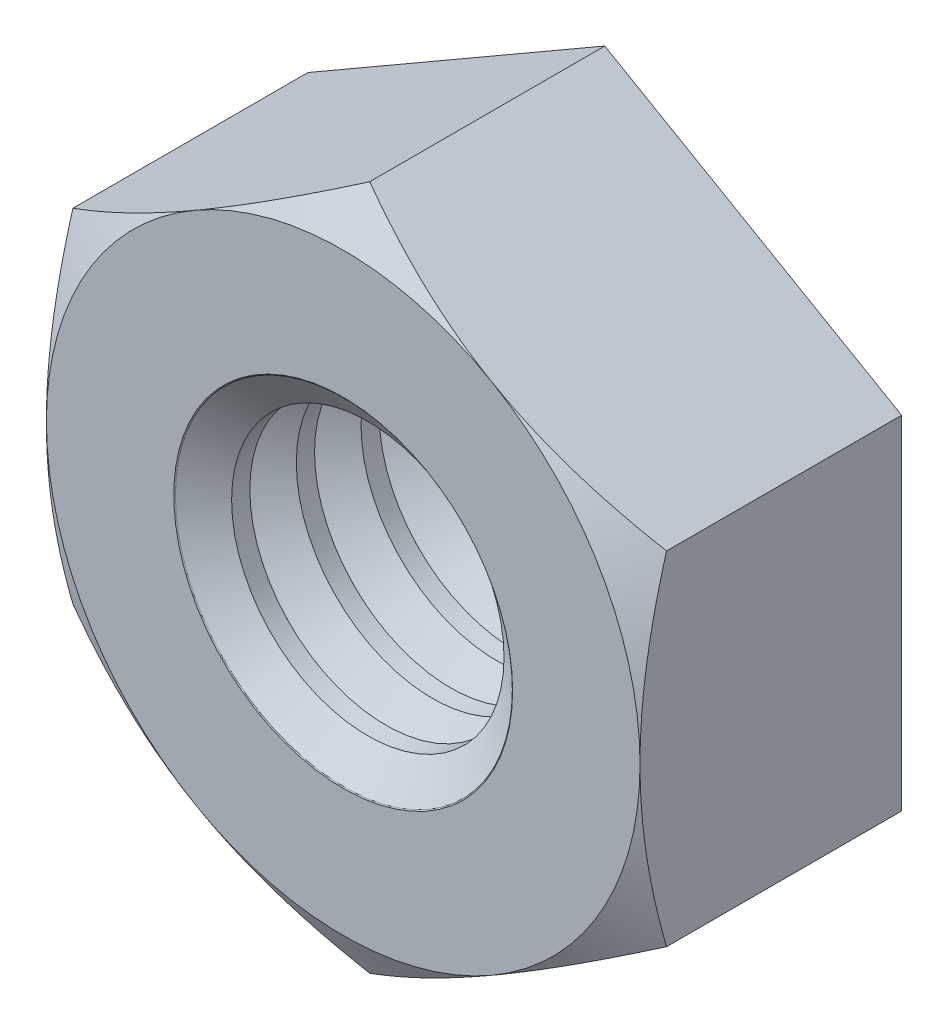
ISO-10303-21;
HEADER;
FILE_DESCRIPTION(('STEP AP214'),'2;1');
FILE_NAME('part.step','',(''),(''),'','','');
FILE_SCHEMA(('AUTOMOTIVE_DESIGN { 1 0 10303 214 1 1 1 1 }'));
ENDSEC;
DATA;
#1=APPLICATION_CONTEXT('core data for automotive mechanical design processes');
#2=APPLICATION_PROTOCOL_DEFINITION('international standard','automotive_design',2000,#1);
#3=PRODUCT_CONTEXT('',#1,'mechanical');
#4=PRODUCT('Part','Part','',(#3));
#5=PRODUCT_RELATED_PRODUCT_CATEGORY('part','',(#4));
#6=PRODUCT_DEFINITION_FORMATION('','',#4);
#7=PRODUCT_DEFINITION_CONTEXT('part definition',#1,'design');
#8=PRODUCT_DEFINITION('design','',#6,#7);
#9=PRODUCT_DEFINITION_SHAPE('','',#8);
#10=(LENGTH_UNIT() NAMED_UNIT(*) SI_UNIT(.MILLI.,.METRE.));
#11=(NAMED_UNIT(*) PLANE_ANGLE_UNIT() SI_UNIT($,.RADIAN.));
#12=(NAMED_UNIT(*) SI_UNIT($,.STERADIAN.) SOLID_ANGLE_UNIT());
#13=UNCERTAINTY_MEASURE_WITH_UNIT(LENGTH_MEASURE(1.E-05),#10,'distance_accuracy_value','');
#14=(GEOMETRIC_REPRESENTATION_CONTEXT(3) GLOBAL_UNCERTAINTY_ASSIGNED_CONTEXT((#13)) GLOBAL_UNIT_ASSIGNED_CONTEXT((#10,
#11,#12)) REPRESENTATION_CONTEXT('',''));
#15=CARTESIAN_POINT('',(0.,0.,0.));
#16=DIRECTION('',(0.,0.,1.));
#17=DIRECTION('',(1.,0.,0.));
#18=AXIS2_PLACEMENT_3D('',#15,#16,#17);
#19=CARTESIAN_POINT('',(0.,0.,-4.9022));
#20=DIRECTION('',(0.,0.,1.));
#21=DIRECTION('',(1.,0.,0.));
#22=AXIS2_PLACEMENT_3D('',#19,#20,#21);
#23=CYLINDRICAL_SURFACE('',#22,2.5527);
#24=CARTESIAN_POINT('',(0.,0.,-4.09968915102791));
#25=DIRECTION('',(0.,0.,-1.));
#26=DIRECTION('',(-1.,0.,0.));
#27=AXIS2_PLACEMENT_3D('',#24,#25,#26);
#28=CIRCLE('',#27,2.5527);
#29=CARTESIAN_POINT('',(-2.5527,0.,-4.09968915102791));
#30=VERTEX_POINT('',#29);
#31=EDGE_CURVE('E618',#30,#30,#28,.T.);
#32=ORIENTED_EDGE('',*,*,#31,.F.);
#33=EDGE_LOOP('',(#32));
#34=FACE_BOUND('',#33,.T.);
#35=CARTESIAN_POINT('',(0.,0.,-4.44106084897209));
#36=DIRECTION('',(0.,0.,-1.));
#37=DIRECTION('',(-1.,0.,0.));
#38=AXIS2_PLACEMENT_3D('',#35,#36,#37);
#39=CIRCLE('',#38,2.5527);
#40=CARTESIAN_POINT('',(-2.5527,0.,-4.44106084897209));
#41=VERTEX_POINT('',#40);
#42=EDGE_CURVE('E275',#41,#41,#39,.F.);
#43=ORIENTED_EDGE('',*,*,#42,.F.);
#44=EDGE_LOOP('',(#43));
#45=FACE_BOUND('',#44,.T.);
#46=ADVANCED_FACE('F38',(#34,#45),#23,.F.);
#47=CARTESIAN_POINT('',(0.,0.,-3.22821084897211));
#48=DIRECTION('',(0.,0.,-1.));
#49=DIRECTION('',(-1.,0.,0.));
#50=AXIS2_PLACEMENT_3D('',#47,#48,#49);
#51=CIRCLE('',#50,2.5527);
#52=CARTESIAN_POINT('',(-2.5527,0.,-3.22821084897211));
#53=VERTEX_POINT('',#52);
#54=EDGE_CURVE('E620',#53,#53,#51,.T.);
#55=ORIENTED_EDGE('',*,*,#54,.T.);
#56=EDGE_LOOP('',(#55));
#57=FACE_BOUND('',#56,.T.);
#58=CARTESIAN_POINT('',(0.,0.,-2.88683915102791));
#59=DIRECTION('',(0.,0.,-1.));
#60=DIRECTION('',(-1.,0.,0.));
#61=AXIS2_PLACEMENT_3D('',#58,#59,#60);
#62=CIRCLE('',#61,2.5527);
#63=CARTESIAN_POINT('',(-2.5527,0.,-2.88683915102791));
#64=VERTEX_POINT('',#63);
#65=EDGE_CURVE('E633',#64,#64,#62,.T.);
#66=ORIENTED_EDGE('',*,*,#65,.F.);
#67=EDGE_LOOP('',(#66));
#68=FACE_BOUND('',#67,.T.);
#69=ADVANCED_FACE('F228',(#57,#68),#23,.F.);
#70=CARTESIAN_POINT('',(0.,0.,-2.01536084897211));
#71=DIRECTION('',(0.,0.,-1.));
#72=DIRECTION('',(-1.,0.,0.));
#73=AXIS2_PLACEMENT_3D('',#70,#71,#72);
#74=CIRCLE('',#73,2.5527);
#75=CARTESIAN_POINT('',(-2.5527,0.,-2.01536084897211));
#76=VERTEX_POINT('',#75);
#77=EDGE_CURVE('E625',#76,#76,#74,.T.);
#78=ORIENTED_EDGE('',*,*,#77,.T.);
#79=EDGE_LOOP('',(#78));
#80=FACE_BOUND('',#79,.T.);
#81=CARTESIAN_POINT('',(0.,0.,-1.67398915102791));
#82=DIRECTION('',(0.,0.,-1.));
#83=DIRECTION('',(-1.,0.,0.));
#84=AXIS2_PLACEMENT_3D('',#81,#82,#83);
#85=CIRCLE('',#84,2.5527);
#86=CARTESIAN_POINT('',(-2.5527,0.,-1.67398915102791));
#87=VERTEX_POINT('',#86);
#88=EDGE_CURVE('E264',#87,#87,#85,.T.);
#89=ORIENTED_EDGE('',*,*,#88,.F.);
#90=EDGE_LOOP('',(#89));
#91=FACE_BOUND('',#90,.T.);
#92=ADVANCED_FACE('F233',(#80,#91),#23,.F.);
#93=CARTESIAN_POINT('',(0.,0.,-0.802510848972107));
#94=DIRECTION('',(0.,0.,-1.));
#95=DIRECTION('',(-1.,0.,0.));
#96=AXIS2_PLACEMENT_3D('',#93,#94,#95);
#97=CIRCLE('',#96,2.5527);
#98=CARTESIAN_POINT('',(-2.5527,0.,-0.802510848972107));
#99=VERTEX_POINT('',#98);
#100=EDGE_CURVE('E249',#99,#99,#97,.T.);
#101=ORIENTED_EDGE('',*,*,#100,.T.);
#102=EDGE_LOOP('',(#101));
#103=FACE_BOUND('',#102,.T.);
#104=CARTESIAN_POINT('',(0.,0.,-0.461139151027908));
#105=DIRECTION('',(0.,0.,-1.));
#106=DIRECTION('',(-1.,0.,0.));
#107=AXIS2_PLACEMENT_3D('',#104,#105,#106);
#108=CIRCLE('',#107,2.5527);
#109=CARTESIAN_POINT('',(-2.5527,0.,-0.461139151027908));
#110=VERTEX_POINT('',#109);
#111=EDGE_CURVE('E252',#110,#110,#108,.T.);
#112=ORIENTED_EDGE('',*,*,#111,.F.);
#113=EDGE_LOOP('',(#112));
#114=FACE_BOUND('',#113,.T.);
#115=ADVANCED_FACE('F188',(#103,#114),#23,.F.);
#116=CARTESIAN_POINT('',(0.,6.42313721478843,-4.9022));
#117=DIRECTION('',(-0.500000000000001,0.866025403784438,0.));
#118=DIRECTION('',(-0.866025403784438,-0.500000000000001,0.));
#119=AXIS2_PLACEMENT_3D('',#116,#117,#118);
#120=PLANE('',#119);
#121=DIRECTION('',(0.,0.,1.));
#122=VECTOR('',#121,1.);
#123=CARTESIAN_POINT('',(-5.5626,3.21156860739421,-4.9022));
#124=LINE('',#123,#122);
#125=CARTESIAN_POINT('',(-5.5626,3.21156860739421,-4.9022));
#126=VERTEX_POINT('',#125);
#127=CARTESIAN_POINT('',(-5.5626,3.21156860739421,-0.49683139260579));
#128=VERTEX_POINT('',#127);
#129=EDGE_CURVE('E290',#126,#128,#124,.T.);
#130=ORIENTED_EDGE('',*,*,#129,.T.);
#131=CARTESIAN_POINT('',(-5.5628,3.21145313734037,-0.496898061070143));
#132=CARTESIAN_POINT('',(-5.44052742579051,3.28204724097473,-0.45614620225513));
#133=CARTESIAN_POINT('',(-5.31779895987524,3.35290455380814,-0.417243775308723));
#134=CARTESIAN_POINT('',(-5.07134533701076,3.49519461931171,-0.343647161560542));
#135=CARTESIAN_POINT('',(-4.9476197744618,3.56662760615499,-0.308954790139043));
#136=CARTESIAN_POINT('',(-4.57446205540738,3.78207031570124,-0.211873701066853));
#137=CARTESIAN_POINT('',(-4.32355690787704,3.92693047016895,-0.156654841923371));
#138=CARTESIAN_POINT('',(-3.94808191278054,4.14371105966188,-0.0919037861815263));
#139=CARTESIAN_POINT('',(-3.8246339686256,4.21498376345064,-0.0734579983429324));
#140=CARTESIAN_POINT('',(-3.57718026600868,4.3578512252685,-0.0425268916674606));
#141=CARTESIAN_POINT('',(-3.45317455781052,4.42944595427775,-0.030041046189007));
#142=CARTESIAN_POINT('',(-3.20494775357179,4.57275976652507,-0.0113480299394697));
#143=CARTESIAN_POINT('',(-3.08072706298072,4.64447861567674,-0.0051337334058461));
#144=CARTESIAN_POINT('',(-2.8321777704527,4.78797861662468,0.000889599359096276));
#145=CARTESIAN_POINT('',(-2.70784917196775,4.85975976642794,0.000698833448296866));
#146=CARTESIAN_POINT('',(-2.36722460466015,5.05641945205558,-0.00862810136342291));
#147=CARTESIAN_POINT('',(-2.15104012289184,5.18123362079914,-0.0242873955350765));
#148=CARTESIAN_POINT('',(-1.72010704725998,5.4300329480179,-0.0739443233816071));
#149=CARTESIAN_POINT('',(-1.50535996905277,5.55401723142852,-0.10795893142346));
#150=CARTESIAN_POINT('',(-1.0735595573113,5.80331731538365,-0.19298604140968));
#151=CARTESIAN_POINT('',(-0.856560712116212,5.92860165707087,-0.244358813937405));
#152=CARTESIAN_POINT('',(-0.425799188774084,6.17730193852898,-0.360954456999598));
#153=CARTESIAN_POINT('',(-0.212030993492364,6.30072106361907,-0.426149937617064));
#154=CARTESIAN_POINT('',(0.000199999999999103,6.42325268484226,-0.496898061070144));
#155=B_SPLINE_CURVE_WITH_KNOTS('',3,(#131,#132,#133,#134,#135,#136,#137,#138,#139,#140,#141,
#142,#143,#144,#145,#146,#147,#148,#149,#150,#151,#152,#153,#154),.UNSPECIFIED.,.F.,.F.,(4,2,2,
2,2,2,2,2,2,2,2,4),(0.,0.44082011856227,0.881829648847401,1.76568130465017,2.19678242164486,
2.62784543796583,3.05841812523868,3.48897751176353,4.23854798324166,4.98881282275669,
5.75571809391027,6.52111769989992),.UNSPECIFIED.);
#156=CARTESIAN_POINT('',(-2.7813,4.81735291109132,0.));
#157=VERTEX_POINT('',#156);
#158=EDGE_CURVE('E63',#128,#157,#155,.T.);
#159=ORIENTED_EDGE('',*,*,#158,.T.);
#160=CARTESIAN_POINT('',(0.,6.42313721478843,-0.496831392605789));
#161=VERTEX_POINT('',#160);
#162=EDGE_CURVE('E158',#157,#161,#155,.T.);
#163=ORIENTED_EDGE('',*,*,#162,.T.);
#164=DIRECTION('',(0.,0.,1.));
#165=VECTOR('',#164,1.);
#166=CARTESIAN_POINT('',(0.,6.42313721478843,-4.9022));
#167=LINE('',#166,#165);
#168=CARTESIAN_POINT('',(0.,6.42313721478843,-4.9022));
#169=VERTEX_POINT('',#168);
#170=EDGE_CURVE('E289',#169,#161,#167,.T.);
#171=ORIENTED_EDGE('',*,*,#170,.F.);
#172=DIRECTION('',(-0.866025403784438,-0.5,0.));
#173=VECTOR('',#172,1.);
#174=CARTESIAN_POINT('',(0.,6.42313721478843,-4.9022));
#175=LINE('',#174,#173);
#176=EDGE_CURVE('E328',#169,#126,#175,.T.);
#177=ORIENTED_EDGE('',*,*,#176,.T.);
#178=EDGE_LOOP('',(#130,#159,#163,#171,#177));
#179=FACE_BOUND('',#178,.T.);
#180=ADVANCED_FACE('F40',(#179),#120,.T.);
#181=CARTESIAN_POINT('',(5.5626,3.21156860739421,-4.9022));
#182=DIRECTION('',(0.5,0.866025403784439,0.));
#183=DIRECTION('',(-0.866025403784439,0.5,0.));
#184=AXIS2_PLACEMENT_3D('',#181,#182,#183);
#185=PLANE('',#184);
#186=ORIENTED_EDGE('',*,*,#170,.T.);
#187=CARTESIAN_POINT('',(-0.00020000000000067,6.42325268484226,-0.496898061070144));
#188=CARTESIAN_POINT('',(0.12207257420949,6.3526585812079,-0.456146202255132));
#189=CARTESIAN_POINT('',(0.244801040124762,6.28180126837449,-0.417243775308724));
#190=CARTESIAN_POINT('',(0.491254662989244,6.13951120287093,-0.343647161560543));
#191=CARTESIAN_POINT('',(0.614980225538198,6.06807821602765,-0.308954790139044));
#192=CARTESIAN_POINT('',(0.988137944592621,5.85263550648139,-0.211873701066854));
#193=CARTESIAN_POINT('',(1.23904309212296,5.70777535201369,-0.156654841923372));
#194=CARTESIAN_POINT('',(1.61451808721946,5.49099476252075,-0.0919037861815271));
#195=CARTESIAN_POINT('',(1.7379660313744,5.41972205873199,-0.0734579983429329));
#196=CARTESIAN_POINT('',(1.98541973399132,5.27685459691414,-0.0425268916674609));
#197=CARTESIAN_POINT('',(2.10942544218948,5.20525986790488,-0.0300410461890072));
#198=CARTESIAN_POINT('',(2.35765224642821,5.06194605565757,-0.01134802993947));
#199=CARTESIAN_POINT('',(2.48187293701928,4.9902272065059,-0.0051337334058465));
#200=CARTESIAN_POINT('',(2.7304222295473,4.84672720555795,0.000889599359095676));
#201=CARTESIAN_POINT('',(2.85475082803225,4.7749460557547,0.000698833448296182));
#202=CARTESIAN_POINT('',(3.19537539533985,4.57828637012706,-0.00862810136342344));
#203=CARTESIAN_POINT('',(3.41155987710816,4.4534722013835,-0.0242873955350765));
#204=CARTESIAN_POINT('',(3.84249295274002,4.20467287416474,-0.0739443233816066));
#205=CARTESIAN_POINT('',(4.05724003094723,4.08068859075412,-0.10795893142346));
#206=CARTESIAN_POINT('',(4.4890404426887,3.83138850679899,-0.192986041409679));
#207=CARTESIAN_POINT('',(4.70603928788379,3.70610416511176,-0.244358813937404));
#208=CARTESIAN_POINT('',(5.13680081122592,3.45740388365365,-0.360954456999597));
#209=CARTESIAN_POINT('',(5.35056900650764,3.33398475856357,-0.426149937617063));
#210=CARTESIAN_POINT('',(5.5628,3.21145313734037,-0.496898061070143));
#211=B_SPLINE_CURVE_WITH_KNOTS('',3,(#187,#188,#189,#190,#191,#192,#193,#194,#195,#196,#197,
#198,#199,#200,#201,#202,#203,#204,#205,#206,#207,#208,#209,#210),.UNSPECIFIED.,.F.,.F.,(4,2,2,
2,2,2,2,2,2,2,2,4),(0.,0.440820118562271,0.881829648847401,1.76568130465017,2.19678242164487,
2.62784543796583,3.05841812523868,3.48897751176353,4.23854798324166,4.98881282275669,
5.75571809391027,6.52111769989992),.UNSPECIFIED.);
#212=CARTESIAN_POINT('',(2.7813,4.81735291109132,0.));
#213=VERTEX_POINT('',#212);
#214=EDGE_CURVE('E155',#161,#213,#211,.T.);
#215=ORIENTED_EDGE('',*,*,#214,.T.);
#216=CARTESIAN_POINT('',(5.5626,3.21156860739421,-0.496831392605789));
#217=VERTEX_POINT('',#216);
#218=EDGE_CURVE('E133',#213,#217,#211,.T.);
#219=ORIENTED_EDGE('',*,*,#218,.T.);
#220=DIRECTION('',(0.,0.,1.));
#221=VECTOR('',#220,1.);
#222=CARTESIAN_POINT('',(5.5626,3.21156860739421,-4.9022));
#223=LINE('',#222,#221);
#224=CARTESIAN_POINT('',(5.5626,3.21156860739421,-4.9022));
#225=VERTEX_POINT('',#224);
#226=EDGE_CURVE('E150',#225,#217,#223,.T.);
#227=ORIENTED_EDGE('',*,*,#226,.F.);
#228=DIRECTION('',(-0.866025403784438,0.5,0.));
#229=VECTOR('',#228,1.);
#230=CARTESIAN_POINT('',(5.5626,3.21156860739421,-4.9022));
#231=LINE('',#230,#229);
#232=EDGE_CURVE('E295',#225,#169,#231,.T.);
#233=ORIENTED_EDGE('',*,*,#232,.T.);
#234=EDGE_LOOP('',(#186,#215,#219,#227,#233));
#235=FACE_BOUND('',#234,.T.);
#236=ADVANCED_FACE('F243',(#235),#185,.T.);
#237=CARTESIAN_POINT('',(5.5626,3.21156860739421,-4.9022));
#238=DIRECTION('',(-1.,0.,0.));
#239=DIRECTION('',(0.,0.,1.));
#240=AXIS2_PLACEMENT_3D('',#237,#238,#239);
#241=PLANE('',#240);
#242=CARTESIAN_POINT('',(5.5626,-8.51755323283637,-2.6618526509583));
#243=CARTESIAN_POINT('',(5.5626,-8.27332363806112,-2.5438274196232));
#244=CARTESIAN_POINT('',(5.5626,-8.02851660217952,-2.42697545724535));
#245=CARTESIAN_POINT('',(5.5626,-7.53743543039807,-2.19628851555291));
#246=CARTESIAN_POINT('',(5.5626,-7.29116104940888,-2.08245405859539));
#247=CARTESIAN_POINT('',(5.5626,-6.79550261529566,-1.85787288673166));
#248=CARTESIAN_POINT('',(5.5626,-6.54610883179355,-1.74714756958911));
#249=CARTESIAN_POINT('',(5.5626,-6.04527145316439,-1.53045285973999));
#250=CARTESIAN_POINT('',(5.5626,-5.79382796569385,-1.42448321912892));
#251=CARTESIAN_POINT('',(5.5626,-5.28536985938512,-1.2173063777394));
#252=CARTESIAN_POINT('',(5.5626,-5.02832474245623,-1.11617361691786));
#253=CARTESIAN_POINT('',(5.5626,-4.51120244313152,-0.921828846462366));
#254=CARTESIAN_POINT('',(5.5626,-4.25112492704733,-0.828617718068565));
#255=CARTESIAN_POINT('',(5.5626,-3.72805915600318,-0.65262051079824));
#256=CARTESIAN_POINT('',(5.5626,-3.46507843403138,-0.569812268319847));
#257=CARTESIAN_POINT('',(5.5626,-2.93537565240331,-0.417311140271069));
#258=CARTESIAN_POINT('',(5.5626,-2.66865480466814,-0.34761410715728));
#259=CARTESIAN_POINT('',(5.5626,-2.13130244368554,-0.22471541607373));
#260=CARTESIAN_POINT('',(5.5626,-1.86066990920863,-0.171518150211024));
#261=CARTESIAN_POINT('',(5.5626,-1.31610403640452,-0.0852140877325591));
#262=CARTESIAN_POINT('',(5.5626,-1.04217069515921,-0.0521073088793156));
#263=CARTESIAN_POINT('',(5.5626,-0.630834751400419,-0.0196373147843429));
#264=CARTESIAN_POINT('',(5.5626,-0.494076025771257,-0.0116773648678606));
#265=CARTESIAN_POINT('',(5.5626,-0.220337929367824,-0.00155246857106459));
#266=CARTESIAN_POINT('',(5.5626,-0.083358561482022,0.000612553064662322));
#267=CARTESIAN_POINT('',(5.5626,0.19052798623461,-0.000910564784260178));
#268=CARTESIAN_POINT('',(5.5626,0.327435175535792,-0.00459706159562195));
#269=CARTESIAN_POINT('',(5.5626,0.600975289543898,-0.0177297883882741));
#270=CARTESIAN_POINT('',(5.5626,0.737608200212512,-0.0271763060032329));
#271=CARTESIAN_POINT('',(5.5626,1.06876418963153,-0.0568556498145173));
#272=CARTESIAN_POINT('',(5.5626,1.263032785691,-0.0799746799788462));
#273=CARTESIAN_POINT('',(5.5626,1.65008136813439,-0.136574570925671));
#274=CARTESIAN_POINT('',(5.5626,1.84286093346577,-0.170058259955466));
#275=CARTESIAN_POINT('',(5.5626,2.22677234634107,-0.246199966011831));
#276=CARTESIAN_POINT('',(5.5626,2.41790245700258,-0.288866657423305));
#277=CARTESIAN_POINT('',(5.5626,2.79819622482316,-0.382072541731626));
#278=CARTESIAN_POINT('',(5.5626,2.98736006544265,-0.432610993000993));
#279=CARTESIAN_POINT('',(5.5626,3.36838035193451,-0.541672395139173));
#280=CARTESIAN_POINT('',(5.5626,3.56018914103516,-0.600360697520546));
#281=CARTESIAN_POINT('',(5.5626,3.94177929576714,-0.723536045570759));
#282=CARTESIAN_POINT('',(5.5626,4.1315619601666,-0.788019091613936));
#283=CARTESIAN_POINT('',(5.5626,4.50833833653701,-0.921451966679669));
#284=CARTESIAN_POINT('',(5.5626,4.69534173392169,-0.990374610698353));
#285=CARTESIAN_POINT('',(5.5626,5.06789764166533,-1.13226526544913));
#286=CARTESIAN_POINT('',(5.5626,5.25344953055567,-1.20523491118044));
#287=CARTESIAN_POINT('',(5.5626,5.43832732995833,-1.27982771994735));
#288=B_SPLINE_CURVE_WITH_KNOTS('',3,(#242,#243,#244,#245,#246,#247,#248,#249,#250,#251,#252,
#253,#254,#255,#256,#257,#258,#259,#260,#261,#262,#263,#264,#265,#266,#267,#268,#269,#270,#271,
#272,#273,#274,#275,#276,#277,#278,#279,#280,#281,#282,#283,#284,#285,#286,#287),.UNSPECIFIED.,
.F.,.F.,(4,2,2,2,2,2,2,2,2,2,2,2,2,2,2,2,2,2,2,2,2,2,4),(0.,0.813769153285017,1.62767826928287,
2.44624505844444,3.26476912757194,4.09334213197154,4.92200719045545,5.74887568591705,
6.57548217189049,7.40230850547899,8.22913557008482,8.64000180756482,9.05086270933453,
9.46160829216969,9.87237438776677,10.4589658361105,11.0457174914015,11.633025851848,
12.2202789132433,12.8219268163372,13.4231625958885,14.0210142165529,14.6191091556215),.UNSPECIFIED.);
#289=CARTESIAN_POINT('',(5.5626,-3.21156860739421,-0.496831392605789));
#290=VERTEX_POINT('',#289);
#291=CARTESIAN_POINT('',(5.5626,0.,0.));
#292=VERTEX_POINT('',#291);
#293=EDGE_CURVE('E113',#290,#292,#288,.T.);
#294=ORIENTED_EDGE('',*,*,#293,.F.);
#295=DIRECTION('',(0.,0.,1.));
#296=VECTOR('',#295,1.);
#297=CARTESIAN_POINT('',(5.5626,-3.21156860739421,-4.9022));
#298=LINE('',#297,#296);
#299=CARTESIAN_POINT('',(5.5626,-3.21156860739421,-4.9022));
#300=VERTEX_POINT('',#299);
#301=EDGE_CURVE('E302',#300,#290,#298,.T.);
#302=ORIENTED_EDGE('',*,*,#301,.F.);
#303=DIRECTION('',(0.,-1.,0.));
#304=VECTOR('',#303,1.);
#305=CARTESIAN_POINT('',(5.5626,3.21156860739421,-4.9022));
#306=LINE('',#305,#304);
#307=EDGE_CURVE('E313',#225,#300,#306,.T.);
#308=ORIENTED_EDGE('',*,*,#307,.F.);
#309=ORIENTED_EDGE('',*,*,#226,.T.);
#310=EDGE_CURVE('E127',#292,#217,#288,.T.);
#311=ORIENTED_EDGE('',*,*,#310,.F.);
#312=EDGE_LOOP('',(#294,#302,#308,#309,#311));
#313=FACE_BOUND('',#312,.T.);
#314=ADVANCED_FACE('F148',(#313),#241,.F.);
#315=CARTESIAN_POINT('',(0.,-6.42313721478843,-4.9022));
#316=DIRECTION('',(0.5,-0.866025403784438,0.));
#317=DIRECTION('',(0.866025403784438,0.5,0.));
#318=AXIS2_PLACEMENT_3D('',#315,#316,#317);
#319=PLANE('',#318);
#320=ORIENTED_EDGE('',*,*,#301,.T.);
#321=CARTESIAN_POINT('',(5.5628,-3.21145313734038,-0.496898061070144));
#322=CARTESIAN_POINT('',(5.44052742579051,-3.28204724097473,-0.456146202255132));
#323=CARTESIAN_POINT('',(5.31779895987524,-3.35290455380815,-0.417243775308724));
#324=CARTESIAN_POINT('',(5.07134533701076,-3.49519461931171,-0.343647161560543));
#325=CARTESIAN_POINT('',(4.9476197744618,-3.56662760615499,-0.308954790139044));
#326=CARTESIAN_POINT('',(4.57446205540738,-3.78207031570125,-0.211873701066854));
#327=CARTESIAN_POINT('',(4.32355690787704,-3.92693047016895,-0.156654841923373));
#328=CARTESIAN_POINT('',(3.94808191278054,-4.14371105966189,-0.0919037861815278));
#329=CARTESIAN_POINT('',(3.8246339686256,-4.21498376345065,-0.0734579983429333));
#330=CARTESIAN_POINT('',(3.57718026600868,-4.3578512252685,-0.0425268916674616));
#331=CARTESIAN_POINT('',(3.45317455781052,-4.42944595427776,-0.0300410461890085));
#332=CARTESIAN_POINT('',(3.20494775357179,-4.57275976652507,-0.0113480299394714));
#333=CARTESIAN_POINT('',(3.08072706298072,-4.64447861567674,-0.00513373340584731));
#334=CARTESIAN_POINT('',(2.8321777704527,-4.78797861662469,0.000889599359094995));
#335=CARTESIAN_POINT('',(2.70784917196775,-4.85975976642794,0.000698833448295009));
#336=CARTESIAN_POINT('',(2.36722460466015,-5.05641945205558,-0.00862810136342551));
#337=CARTESIAN_POINT('',(2.15104012289184,-5.18123362079914,-0.0242873955350786));
#338=CARTESIAN_POINT('',(1.72010704725998,-5.4300329480179,-0.0739443233816088));
#339=CARTESIAN_POINT('',(1.50535996905277,-5.55401723142852,-0.107958931423462));
#340=CARTESIAN_POINT('',(1.0735595573113,-5.80331731538365,-0.192986041409682));
#341=CARTESIAN_POINT('',(0.856560712116212,-5.92860165707088,-0.244358813937407));
#342=CARTESIAN_POINT('',(0.425799188774084,-6.17730193852899,-0.3609544569996));
#343=CARTESIAN_POINT('',(0.212030993492364,-6.30072106361907,-0.426149937617066));
#344=CARTESIAN_POINT('',(-0.000199999999999032,-6.42325268484227,-0.496898061070146));
#345=B_SPLINE_CURVE_WITH_KNOTS('',3,(#321,#322,#323,#324,#325,#326,#327,#328,#329,#330,#331,
#332,#333,#334,#335,#336,#337,#338,#339,#340,#341,#342,#343,#344),.UNSPECIFIED.,.F.,.F.,(4,2,2,
2,2,2,2,2,2,2,2,4),(0.,0.44082011856227,0.8818296488474,1.76568130465017,2.19678242164487,
2.62784543796583,3.05841812523868,3.48897751176353,4.23854798324166,4.9888128227567,
5.75571809391027,6.52111769989992),.UNSPECIFIED.);
#346=CARTESIAN_POINT('',(2.7813,-4.81735291109132,0.));
#347=VERTEX_POINT('',#346);
#348=EDGE_CURVE('E120',#290,#347,#345,.T.);
#349=ORIENTED_EDGE('',*,*,#348,.T.);
#350=CARTESIAN_POINT('',(0.,-6.42313721478842,-0.496831392605789));
#351=VERTEX_POINT('',#350);
#352=EDGE_CURVE('E166',#347,#351,#345,.T.);
#353=ORIENTED_EDGE('',*,*,#352,.T.);
#354=DIRECTION('',(0.,0.,1.));
#355=VECTOR('',#354,1.);
#356=CARTESIAN_POINT('',(0.,-6.42313721478843,-4.9022));
#357=LINE('',#356,#355);
#358=CARTESIAN_POINT('',(0.,-6.42313721478843,-4.9022));
#359=VERTEX_POINT('',#358);
#360=EDGE_CURVE('E298',#359,#351,#357,.T.);
#361=ORIENTED_EDGE('',*,*,#360,.F.);
#362=DIRECTION('',(0.866025403784438,0.5,0.));
#363=VECTOR('',#362,1.);
#364=CARTESIAN_POINT('',(0.,-6.42313721478843,-4.9022));
#365=LINE('',#364,#363);
#366=EDGE_CURVE('E316',#359,#300,#365,.T.);
#367=ORIENTED_EDGE('',*,*,#366,.T.);
#368=EDGE_LOOP('',(#320,#349,#353,#361,#367));
#369=FACE_BOUND('',#368,.T.);
#370=ADVANCED_FACE('F214',(#369),#319,.T.);
#371=CARTESIAN_POINT('',(-5.5626,-3.21156860739422,-4.9022));
#372=DIRECTION('',(-0.5,-0.866025403784439,0.));
#373=DIRECTION('',(0.866025403784439,-0.5,0.));
#374=AXIS2_PLACEMENT_3D('',#371,#372,#373);
#375=PLANE('',#374);
#376=ORIENTED_EDGE('',*,*,#360,.T.);
#377=CARTESIAN_POINT('',(0.000200000000000751,-6.42325268484227,-0.496898061070146));
#378=CARTESIAN_POINT('',(-0.12207257420949,-6.35265858120791,-0.456146202255133));
#379=CARTESIAN_POINT('',(-0.244801040124762,-6.2818012683745,-0.417243775308725));
#380=CARTESIAN_POINT('',(-0.491254662989244,-6.13951120287093,-0.343647161560545));
#381=CARTESIAN_POINT('',(-0.614980225538198,-6.06807821602765,-0.308954790139046));
#382=CARTESIAN_POINT('',(-0.988137944592622,-5.85263550648139,-0.211873701066856));
#383=CARTESIAN_POINT('',(-1.23904309212296,-5.70777535201369,-0.156654841923374));
#384=CARTESIAN_POINT('',(-1.61451808721946,-5.49099476252075,-0.0919037861815287));
#385=CARTESIAN_POINT('',(-1.7379660313744,-5.41972205873199,-0.0734579983429346));
#386=CARTESIAN_POINT('',(-1.98541973399132,-5.27685459691414,-0.0425268916674629));
#387=CARTESIAN_POINT('',(-2.10942544218948,-5.20525986790488,-0.0300410461890094));
#388=CARTESIAN_POINT('',(-2.35765224642821,-5.06194605565757,-0.0113480299394719));
#389=CARTESIAN_POINT('',(-2.48187293701928,-4.9902272065059,-0.00513373340584785));
#390=CARTESIAN_POINT('',(-2.7304222295473,-4.84672720555795,0.000889599359094531));
#391=CARTESIAN_POINT('',(-2.85475082803226,-4.7749460557547,0.000698833448294746));
#392=CARTESIAN_POINT('',(-3.19537539533985,-4.57828637012706,-0.00862810136342539));
#393=CARTESIAN_POINT('',(-3.41155987710816,-4.4534722013835,-0.0242873955350784));
#394=CARTESIAN_POINT('',(-3.84249295274002,-4.20467287416474,-0.0739443233816083));
#395=CARTESIAN_POINT('',(-4.05724003094723,-4.08068859075412,-0.107958931423461));
#396=CARTESIAN_POINT('',(-4.4890404426887,-3.83138850679899,-0.192986041409681));
#397=CARTESIAN_POINT('',(-4.70603928788379,-3.70610416511177,-0.244358813937406));
#398=CARTESIAN_POINT('',(-5.13680081122592,-3.45740388365366,-0.3609544569996));
#399=CARTESIAN_POINT('',(-5.35056900650764,-3.33398475856358,-0.426149937617065));
#400=CARTESIAN_POINT('',(-5.5628,-3.21145313734038,-0.496898061070144));
#401=B_SPLINE_CURVE_WITH_KNOTS('',3,(#377,#378,#379,#380,#381,#382,#383,#384,#385,#386,#387,
#388,#389,#390,#391,#392,#393,#394,#395,#396,#397,#398,#399,#400),.UNSPECIFIED.,.F.,.F.,(4,2,2,
2,2,2,2,2,2,2,2,4),(0.,0.440820118562271,0.881829648847401,1.76568130465017,2.19678242164487,
2.62784543796583,3.05841812523868,3.48897751176353,4.23854798324166,4.9888128227567,
5.75571809391027,6.52111769989992),.UNSPECIFIED.);
#402=CARTESIAN_POINT('',(-2.7813,-4.81735291109132,0.));
#403=VERTEX_POINT('',#402);
#404=EDGE_CURVE('E208',#351,#403,#401,.T.);
#405=ORIENTED_EDGE('',*,*,#404,.T.);
#406=CARTESIAN_POINT('',(-5.5626,-3.21156860739421,-0.496831392605789));
#407=VERTEX_POINT('',#406);
#408=EDGE_CURVE('E199',#403,#407,#401,.T.);
#409=ORIENTED_EDGE('',*,*,#408,.T.);
#410=DIRECTION('',(0.,0.,1.));
#411=VECTOR('',#410,1.);
#412=CARTESIAN_POINT('',(-5.5626,-3.21156860739422,-4.9022));
#413=LINE('',#412,#411);
#414=CARTESIAN_POINT('',(-5.5626,-3.21156860739422,-4.9022));
#415=VERTEX_POINT('',#414);
#416=EDGE_CURVE('E294',#415,#407,#413,.T.);
#417=ORIENTED_EDGE('',*,*,#416,.F.);
#418=DIRECTION('',(0.866025403784439,-0.5,0.));
#419=VECTOR('',#418,1.);
#420=CARTESIAN_POINT('',(-5.5626,-3.21156860739422,-4.9022));
#421=LINE('',#420,#419);
#422=EDGE_CURVE('E320',#415,#359,#421,.T.);
#423=ORIENTED_EDGE('',*,*,#422,.T.);
#424=EDGE_LOOP('',(#376,#405,#409,#417,#423));
#425=FACE_BOUND('',#424,.T.);
#426=ADVANCED_FACE('F210',(#425),#375,.T.);
#427=CARTESIAN_POINT('',(-5.5626,3.21156860739421,-4.9022));
#428=DIRECTION('',(-1.,0.,0.));
#429=DIRECTION('',(0.,0.,1.));
#430=AXIS2_PLACEMENT_3D('',#427,#428,#429);
#431=PLANE('',#430);
#432=ORIENTED_EDGE('',*,*,#416,.T.);
#433=CARTESIAN_POINT('',(-5.5626,-8.51755323283637,-2.6618526509583));
#434=CARTESIAN_POINT('',(-5.5626,-8.27332363806113,-2.5438274196232));
#435=CARTESIAN_POINT('',(-5.5626,-8.02851660217952,-2.42697545724535));
#436=CARTESIAN_POINT('',(-5.5626,-7.53743543039807,-2.19628851555291));
#437=CARTESIAN_POINT('',(-5.5626,-7.29116104940888,-2.08245405859539));
#438=CARTESIAN_POINT('',(-5.5626,-6.79550261529566,-1.85787288673166));
#439=CARTESIAN_POINT('',(-5.5626,-6.54610883179355,-1.74714756958911));
#440=CARTESIAN_POINT('',(-5.5626,-6.04527145316439,-1.53045285973999));
#441=CARTESIAN_POINT('',(-5.5626,-5.79382796569386,-1.42448321912892));
#442=CARTESIAN_POINT('',(-5.5626,-5.28536985938512,-1.2173063777394));
#443=CARTESIAN_POINT('',(-5.5626,-5.02832474245623,-1.11617361691786));
#444=CARTESIAN_POINT('',(-5.5626,-4.51120244313152,-0.921828846462367));
#445=CARTESIAN_POINT('',(-5.5626,-4.25112492704734,-0.828617718068565));
#446=CARTESIAN_POINT('',(-5.5626,-3.72805915600318,-0.652620510798241));
#447=CARTESIAN_POINT('',(-5.5626,-3.46507843403138,-0.569812268319847));
#448=CARTESIAN_POINT('',(-5.5626,-2.93537565240331,-0.41731114027107));
#449=CARTESIAN_POINT('',(-5.5626,-2.66865480466815,-0.34761410715728));
#450=CARTESIAN_POINT('',(-5.5626,-2.13130244368554,-0.22471541607373));
#451=CARTESIAN_POINT('',(-5.5626,-1.86066990920863,-0.171518150211025));
#452=CARTESIAN_POINT('',(-5.5626,-1.31610403640452,-0.0852140877325596));
#453=CARTESIAN_POINT('',(-5.5626,-1.04217069515921,-0.0521073088793156));
#454=CARTESIAN_POINT('',(-5.5626,-0.630834751400421,-0.0196373147843428));
#455=CARTESIAN_POINT('',(-5.5626,-0.494076025771258,-0.0116773648678606));
#456=CARTESIAN_POINT('',(-5.5626,-0.220337929367825,-0.00155246857106465));
#457=CARTESIAN_POINT('',(-5.5626,-0.0833585614820237,0.000612553064662321));
#458=CARTESIAN_POINT('',(-5.5626,0.190527986234607,-0.000910564784260181));
#459=CARTESIAN_POINT('',(-5.5626,0.32743517553579,-0.00459706159562204));
#460=CARTESIAN_POINT('',(-5.5626,0.600975289543896,-0.017729788388274));
#461=CARTESIAN_POINT('',(-5.5626,0.737608200212509,-0.0271763060032325));
#462=CARTESIAN_POINT('',(-5.5626,1.06876418963153,-0.0568556498145166));
#463=CARTESIAN_POINT('',(-5.5626,1.263032785691,-0.0799746799788456));
#464=CARTESIAN_POINT('',(-5.5626,1.65008136813439,-0.136574570925671));
#465=CARTESIAN_POINT('',(-5.5626,1.84286093346576,-0.170058259955466));
#466=CARTESIAN_POINT('',(-5.5626,2.22677234634106,-0.246199966011831));
#467=CARTESIAN_POINT('',(-5.5626,2.41790245700258,-0.288866657423304));
#468=CARTESIAN_POINT('',(-5.5626,2.79819622482316,-0.382072541731625));
#469=CARTESIAN_POINT('',(-5.5626,2.98736006544264,-0.432610993000992));
#470=CARTESIAN_POINT('',(-5.5626,3.3683803519345,-0.541672395139171));
#471=CARTESIAN_POINT('',(-5.5626,3.56018914103516,-0.600360697520545));
#472=CARTESIAN_POINT('',(-5.5626,3.94177929576713,-0.723536045570759));
#473=CARTESIAN_POINT('',(-5.5626,4.1315619601666,-0.788019091613935));
#474=CARTESIAN_POINT('',(-5.5626,4.50833833653701,-0.921451966679667));
#475=CARTESIAN_POINT('',(-5.5626,4.69534173392169,-0.99037461069835));
#476=CARTESIAN_POINT('',(-5.5626,5.06789764166532,-1.13226526544913));
#477=CARTESIAN_POINT('',(-5.5626,5.25344953055566,-1.20523491118044));
#478=CARTESIAN_POINT('',(-5.5626,5.43832732995832,-1.27982771994735));
#479=B_SPLINE_CURVE_WITH_KNOTS('',3,(#433,#434,#435,#436,#437,#438,#439,#440,#441,#442,#443,
#444,#445,#446,#447,#448,#449,#450,#451,#452,#453,#454,#455,#456,#457,#458,#459,#460,#461,#462,
#463,#464,#465,#466,#467,#468,#469,#470,#471,#472,#473,#474,#475,#476,#477,#478),.UNSPECIFIED.,
.F.,.F.,(4,2,2,2,2,2,2,2,2,2,2,2,2,2,2,2,2,2,2,2,2,2,4),(0.,0.813769153285016,1.62767826928287,
2.44624505844444,3.26476912757194,4.09334213197154,4.92200719045545,5.74887568591706,
6.57548217189049,7.40230850547898,8.22913557008481,8.64000180756482,9.05086270933453,
9.46160829216968,9.87237438776677,10.4589658361105,11.0457174914015,11.633025851848,
12.2202789132433,12.8219268163372,13.4231625958885,14.0210142165529,14.6191091556215),.UNSPECIFIED.);
#480=CARTESIAN_POINT('',(-5.5626,0.,0.));
#481=VERTEX_POINT('',#480);
#482=EDGE_CURVE('E209',#407,#481,#479,.T.);
#483=ORIENTED_EDGE('',*,*,#482,.T.);
#484=EDGE_CURVE('E139',#481,#128,#479,.T.);
#485=ORIENTED_EDGE('',*,*,#484,.T.);
#486=ORIENTED_EDGE('',*,*,#129,.F.);
#487=DIRECTION('',(0.,-1.,0.));
#488=VECTOR('',#487,1.);
#489=CARTESIAN_POINT('',(-5.5626,3.21156860739421,-4.9022));
#490=LINE('',#489,#488);
#491=EDGE_CURVE('E324',#126,#415,#490,.T.);
#492=ORIENTED_EDGE('',*,*,#491,.T.);
#493=EDGE_LOOP('',(#432,#483,#485,#486,#492));
#494=FACE_BOUND('',#493,.T.);
#495=ADVANCED_FACE('F213',(#494),#431,.T.);
#496=CARTESIAN_POINT('',(0.,6.42313721478842,0.));
#497=DIRECTION('',(0.,0.,-1.));
#498=DIRECTION('',(-1.,0.,0.));
#499=AXIS2_PLACEMENT_3D('',#496,#497,#498);
#500=PLANE('',#499);
#501=CARTESIAN_POINT('',(0.,0.,0.));
#502=DIRECTION('',(0.,0.,1.));
#503=DIRECTION('',(1.,0.,0.));
#504=AXIS2_PLACEMENT_3D('',#501,#502,#503);
#505=CIRCLE('',#504,3.175);
#506=CARTESIAN_POINT('',(3.175,0.,0.));
#507=VERTEX_POINT('',#506);
#508=EDGE_CURVE('E140',#507,#507,#505,.T.);
#509=ORIENTED_EDGE('',*,*,#508,.F.);
#510=EDGE_LOOP('',(#509));
#511=FACE_BOUND('',#510,.T.);
#512=CARTESIAN_POINT('',(0.,0.,0.));
#513=DIRECTION('',(0.,0.,-1.));
#514=DIRECTION('',(-1.,0.,0.));
#515=AXIS2_PLACEMENT_3D('',#512,#513,#514);
#516=CIRCLE('',#515,5.5626);
#517=EDGE_CURVE('E51',#157,#481,#516,.F.);
#518=ORIENTED_EDGE('',*,*,#517,.T.);
#519=EDGE_CURVE('E11',#481,#403,#516,.F.);
#520=ORIENTED_EDGE('',*,*,#519,.T.);
#521=EDGE_CURVE('E49',#403,#347,#516,.F.);
#522=ORIENTED_EDGE('',*,*,#521,.T.);
#523=EDGE_CURVE('E117',#347,#292,#516,.F.);
#524=ORIENTED_EDGE('',*,*,#523,.T.);
#525=CARTESIAN_POINT('',(0.,0.,0.));
#526=DIRECTION('',(0.,0.,1.));
#527=DIRECTION('',(1.,0.,0.));
#528=AXIS2_PLACEMENT_3D('',#525,#526,#527);
#529=CIRCLE('',#528,5.5626);
#530=EDGE_CURVE('E130',#292,#213,#529,.T.);
#531=ORIENTED_EDGE('',*,*,#530,.T.);
#532=EDGE_CURVE('E146',#213,#157,#516,.F.);
#533=ORIENTED_EDGE('',*,*,#532,.T.);
#534=EDGE_LOOP('',(#518,#520,#522,#524,#531,#533));
#535=FACE_BOUND('',#534,.T.);
#536=ADVANCED_FACE('F143',(#511,#535),#500,.F.);
#537=CARTESIAN_POINT('',(0.,6.42313721478842,-4.9022));
#538=DIRECTION('',(0.,0.,-1.));
#539=DIRECTION('',(-1.,0.,0.));
#540=AXIS2_PLACEMENT_3D('',#537,#538,#539);
#541=PLANE('',#540);
#542=CARTESIAN_POINT('',(0.,0.,-4.9022));
#543=DIRECTION('',(0.,0.,-1.));
#544=DIRECTION('',(-1.,0.,0.));
#545=AXIS2_PLACEMENT_3D('',#542,#543,#544);
#546=CIRCLE('',#545,3.175);
#547=CARTESIAN_POINT('',(-3.175,0.,-4.9022));
#548=VERTEX_POINT('',#547);
#549=EDGE_CURVE('E272',#548,#548,#546,.F.);
#550=ORIENTED_EDGE('',*,*,#549,.T.);
#551=EDGE_LOOP('',(#550));
#552=FACE_BOUND('',#551,.T.);
#553=ORIENTED_EDGE('',*,*,#176,.F.);
#554=ORIENTED_EDGE('',*,*,#232,.F.);
#555=ORIENTED_EDGE('',*,*,#307,.T.);
#556=ORIENTED_EDGE('',*,*,#366,.F.);
#557=ORIENTED_EDGE('',*,*,#422,.F.);
#558=ORIENTED_EDGE('',*,*,#491,.F.);
#559=EDGE_LOOP('',(#553,#554,#555,#556,#557,#558));
#560=FACE_BOUND('',#559,.T.);
#561=ADVANCED_FACE('F223',(#552,#560),#541,.T.);
#562=CARTESIAN_POINT('',(0.,0.,0.));
#563=DIRECTION('',(0.,0.,-1.));
#564=DIRECTION('',(-1.,0.,0.));
#565=AXIS2_PLACEMENT_3D('',#562,#563,#564);
#566=CONICAL_SURFACE('',#565,5.5626,1.0471975511966);
#567=ORIENTED_EDGE('',*,*,#484,.F.);
#568=ORIENTED_EDGE('',*,*,#517,.F.);
#569=ORIENTED_EDGE('',*,*,#158,.F.);
#570=EDGE_LOOP('',(#567,#568,#569));
#571=FACE_BOUND('',#570,.T.);
#572=ADVANCED_FACE('F339',(#571),#566,.T.);
#573=ORIENTED_EDGE('',*,*,#532,.F.);
#574=ORIENTED_EDGE('',*,*,#214,.F.);
#575=ORIENTED_EDGE('',*,*,#162,.F.);
#576=EDGE_LOOP('',(#573,#574,#575));
#577=FACE_BOUND('',#576,.T.);
#578=ADVANCED_FACE('F186',(#577),#566,.T.);
#579=ORIENTED_EDGE('',*,*,#530,.F.);
#580=ORIENTED_EDGE('',*,*,#310,.T.);
#581=ORIENTED_EDGE('',*,*,#218,.F.);
#582=EDGE_LOOP('',(#579,#580,#581));
#583=FACE_BOUND('',#582,.T.);
#584=ADVANCED_FACE('F131',(#583),#566,.T.);
#585=ORIENTED_EDGE('',*,*,#293,.T.);
#586=ORIENTED_EDGE('',*,*,#523,.F.);
#587=ORIENTED_EDGE('',*,*,#348,.F.);
#588=EDGE_LOOP('',(#585,#586,#587));
#589=FACE_BOUND('',#588,.T.);
#590=ADVANCED_FACE('F115',(#589),#566,.T.);
#591=ORIENTED_EDGE('',*,*,#521,.F.);
#592=ORIENTED_EDGE('',*,*,#404,.F.);
#593=ORIENTED_EDGE('',*,*,#352,.F.);
#594=EDGE_LOOP('',(#591,#592,#593));
#595=FACE_BOUND('',#594,.T.);
#596=ADVANCED_FACE('F185',(#595),#566,.T.);
#597=ORIENTED_EDGE('',*,*,#519,.F.);
#598=ORIENTED_EDGE('',*,*,#482,.F.);
#599=ORIENTED_EDGE('',*,*,#408,.F.);
#600=EDGE_LOOP('',(#597,#598,#599));
#601=FACE_BOUND('',#600,.T.);
#602=ADVANCED_FACE('F179',(#601),#566,.T.);
#603=CARTESIAN_POINT('',(0.,0.,-0.479313066130693));
#604=DIRECTION('',(0.,0.,1.));
#605=DIRECTION('',(1.,0.,0.));
#606=AXIS2_PLACEMENT_3D('',#603,#604,#605);
#607=CONICAL_SURFACE('',#606,2.49047,0.95993108859688);
#608=CARTESIAN_POINT('',(0.,0.,-0.0127000000000005));
#609=DIRECTION('',(0.,0.,-1.));
#610=DIRECTION('',(-1.,0.,0.));
#611=AXIS2_PLACEMENT_3D('',#608,#609,#610);
#612=CIRCLE('',#611,3.15686252031437);
#613=CARTESIAN_POINT('',(-3.15686252031437,0.,-0.0127000000000005));
#614=VERTEX_POINT('',#613);
#615=EDGE_CURVE('E43',#614,#614,#612,.F.);
#616=ORIENTED_EDGE('',*,*,#615,.F.);
#617=EDGE_LOOP('',(#616));
#618=FACE_BOUND('',#617,.T.);
#619=ORIENTED_EDGE('',*,*,#508,.T.);
#620=EDGE_LOOP('',(#619));
#621=FACE_BOUND('',#620,.T.);
#622=ADVANCED_FACE('F184',(#618,#621),#607,.F.);
#623=CARTESIAN_POINT('',(0.,0.,-4.8768));
#624=DIRECTION('',(0.,0.,-1.));
#625=DIRECTION('',(-1.,0.,0.));
#626=AXIS2_PLACEMENT_3D('',#623,#624,#625);
#627=CONICAL_SURFACE('',#626,3.175,0.95993108859688);
#628=CARTESIAN_POINT('',(0.,0.,-4.8768));
#629=DIRECTION('',(0.,0.,1.));
#630=DIRECTION('',(1.,0.,0.));
#631=AXIS2_PLACEMENT_3D('',#628,#629,#630);
#632=CIRCLE('',#631,3.175);
#633=CARTESIAN_POINT('',(3.175,0.,-4.8768));
#634=VERTEX_POINT('',#633);
#635=EDGE_CURVE('E268',#634,#634,#632,.T.);
#636=ORIENTED_EDGE('',*,*,#635,.F.);
#637=EDGE_LOOP('',(#636));
#638=FACE_BOUND('',#637,.T.);
#639=ORIENTED_EDGE('',*,*,#42,.T.);
#640=EDGE_LOOP('',(#639));
#641=FACE_BOUND('',#640,.T.);
#642=ADVANCED_FACE('F519',(#638,#641),#627,.F.);
#643=CARTESIAN_POINT('',(0.,0.,-25.0375057290932));
#644=DIRECTION('',(0.,0.,1.));
#645=DIRECTION('',(1.,0.,0.));
#646=AXIS2_PLACEMENT_3D('',#643,#644,#645);
#647=CYLINDRICAL_SURFACE('',#646,3.175);
#648=ORIENTED_EDGE('',*,*,#549,.F.);
#649=EDGE_LOOP('',(#648));
#650=FACE_BOUND('',#649,.T.);
#651=ORIENTED_EDGE('',*,*,#635,.T.);
#652=EDGE_LOOP('',(#651));
#653=FACE_BOUND('',#652,.T.);
#654=ADVANCED_FACE('F506',(#650,#653),#647,.F.);
#655=CARTESIAN_POINT('',(0.,0.,-0.0254000000000001));
#656=DIRECTION('',(0.,0.,-1.));
#657=DIRECTION('',(-1.,0.,0.));
#658=AXIS2_PLACEMENT_3D('',#655,#656,#657);
#659=CONICAL_SURFACE('',#658,3.175,0.959931088596891);
#660=ORIENTED_EDGE('',*,*,#615,.T.);
#661=EDGE_LOOP('',(#660));
#662=FACE_BOUND('',#661,.T.);
#663=CARTESIAN_POINT('',(0.,0.,-0.0254000000000001));
#664=DIRECTION('',(0.,0.,-1.));
#665=DIRECTION('',(-1.,0.,0.));
#666=AXIS2_PLACEMENT_3D('',#663,#664,#665);
#667=CIRCLE('',#666,3.175);
#668=CARTESIAN_POINT('',(-3.175,0.,-0.0254000000000001));
#669=VERTEX_POINT('',#668);
#670=EDGE_CURVE('E255',#669,#669,#667,.T.);
#671=ORIENTED_EDGE('',*,*,#670,.T.);
#672=EDGE_LOOP('',(#671));
#673=FACE_BOUND('',#672,.T.);
#674=ADVANCED_FACE('F494',(#662,#673),#659,.F.);
#675=CARTESIAN_POINT('',(0.,0.,-0.461139151027908));
#676=DIRECTION('',(0.,0.,1.));
#677=DIRECTION('',(1.,0.,0.));
#678=AXIS2_PLACEMENT_3D('',#675,#676,#677);
#679=CONICAL_SURFACE('',#678,2.5527,0.959931088596875);
#680=ORIENTED_EDGE('',*,*,#670,.F.);
#681=EDGE_LOOP('',(#680));
#682=FACE_BOUND('',#681,.T.);
#683=ORIENTED_EDGE('',*,*,#111,.T.);
#684=EDGE_LOOP('',(#683));
#685=FACE_BOUND('',#684,.T.);
#686=ADVANCED_FACE('F487',(#682,#685),#679,.F.);
#687=CARTESIAN_POINT('',(0.,0.,-1.23825));
#688=DIRECTION('',(0.,0.,-1.));
#689=DIRECTION('',(-1.,0.,0.));
#690=AXIS2_PLACEMENT_3D('',#687,#688,#689);
#691=CONICAL_SURFACE('',#690,3.175,0.959931088596891);
#692=ORIENTED_EDGE('',*,*,#100,.F.);
#693=EDGE_LOOP('',(#692));
#694=FACE_BOUND('',#693,.T.);
#695=CARTESIAN_POINT('',(0.,0.,-1.23825));
#696=DIRECTION('',(0.,0.,-1.));
#697=DIRECTION('',(-1.,0.,0.));
#698=AXIS2_PLACEMENT_3D('',#695,#696,#697);
#699=CIRCLE('',#698,3.175);
#700=CARTESIAN_POINT('',(-3.175,0.,-1.23825));
#701=VERTEX_POINT('',#700);
#702=EDGE_CURVE('E256',#701,#701,#699,.T.);
#703=ORIENTED_EDGE('',*,*,#702,.T.);
#704=EDGE_LOOP('',(#703));
#705=FACE_BOUND('',#704,.T.);
#706=ADVANCED_FACE('F493',(#694,#705),#691,.F.);
#707=CARTESIAN_POINT('',(0.,0.,-1.67398915102791));
#708=DIRECTION('',(0.,0.,1.));
#709=DIRECTION('',(1.,0.,0.));
#710=AXIS2_PLACEMENT_3D('',#707,#708,#709);
#711=CONICAL_SURFACE('',#710,2.5527,0.959931088596875);
#712=ORIENTED_EDGE('',*,*,#702,.F.);
#713=EDGE_LOOP('',(#712));
#714=FACE_BOUND('',#713,.T.);
#715=ORIENTED_EDGE('',*,*,#88,.T.);
#716=EDGE_LOOP('',(#715));
#717=FACE_BOUND('',#716,.T.);
#718=ADVANCED_FACE('F548',(#714,#717),#711,.F.);
#719=CARTESIAN_POINT('',(0.,0.,-2.4511));
#720=DIRECTION('',(0.,0.,-1.));
#721=DIRECTION('',(-1.,0.,0.));
#722=AXIS2_PLACEMENT_3D('',#719,#720,#721);
#723=CONICAL_SURFACE('',#722,3.175,0.959931088596891);
#724=ORIENTED_EDGE('',*,*,#77,.F.);
#725=EDGE_LOOP('',(#724));
#726=FACE_BOUND('',#725,.T.);
#727=CARTESIAN_POINT('',(0.,0.,-2.4511));
#728=DIRECTION('',(0.,0.,-1.));
#729=DIRECTION('',(-1.,0.,0.));
#730=AXIS2_PLACEMENT_3D('',#727,#728,#729);
#731=CIRCLE('',#730,3.175);
#732=CARTESIAN_POINT('',(-3.175,0.,-2.4511));
#733=VERTEX_POINT('',#732);
#734=EDGE_CURVE('E637',#733,#733,#731,.T.);
#735=ORIENTED_EDGE('',*,*,#734,.T.);
#736=EDGE_LOOP('',(#735));
#737=FACE_BOUND('',#736,.T.);
#738=ADVANCED_FACE('F555',(#726,#737),#723,.F.);
#739=CARTESIAN_POINT('',(0.,0.,-2.88683915102791));
#740=DIRECTION('',(0.,0.,1.));
#741=DIRECTION('',(1.,0.,0.));
#742=AXIS2_PLACEMENT_3D('',#739,#740,#741);
#743=CONICAL_SURFACE('',#742,2.5527,0.959931088596875);
#744=ORIENTED_EDGE('',*,*,#734,.F.);
#745=EDGE_LOOP('',(#744));
#746=FACE_BOUND('',#745,.T.);
#747=ORIENTED_EDGE('',*,*,#65,.T.);
#748=EDGE_LOOP('',(#747));
#749=FACE_BOUND('',#748,.T.);
#750=ADVANCED_FACE('F563',(#746,#749),#743,.F.);
#751=CARTESIAN_POINT('',(0.,0.,-3.66395));
#752=DIRECTION('',(0.,0.,-1.));
#753=DIRECTION('',(-1.,0.,0.));
#754=AXIS2_PLACEMENT_3D('',#751,#752,#753);
#755=CONICAL_SURFACE('',#754,3.175,0.959931088596891);
#756=ORIENTED_EDGE('',*,*,#54,.F.);
#757=EDGE_LOOP('',(#756));
#758=FACE_BOUND('',#757,.T.);
#759=CARTESIAN_POINT('',(0.,0.,-3.66395));
#760=DIRECTION('',(0.,0.,-1.));
#761=DIRECTION('',(-1.,0.,0.));
#762=AXIS2_PLACEMENT_3D('',#759,#760,#761);
#763=CIRCLE('',#762,3.175);
#764=CARTESIAN_POINT('',(-3.175,0.,-3.66395));
#765=VERTEX_POINT('',#764);
#766=EDGE_CURVE('E616',#765,#765,#763,.T.);
#767=ORIENTED_EDGE('',*,*,#766,.T.);
#768=EDGE_LOOP('',(#767));
#769=FACE_BOUND('',#768,.T.);
#770=ADVANCED_FACE('F571',(#758,#769),#755,.F.);
#771=CARTESIAN_POINT('',(0.,0.,-4.09968915102791));
#772=DIRECTION('',(0.,0.,1.));
#773=DIRECTION('',(1.,0.,0.));
#774=AXIS2_PLACEMENT_3D('',#771,#772,#773);
#775=CONICAL_SURFACE('',#774,2.5527,0.959931088596875);
#776=ORIENTED_EDGE('',*,*,#766,.F.);
#777=EDGE_LOOP('',(#776));
#778=FACE_BOUND('',#777,.T.);
#779=ORIENTED_EDGE('',*,*,#31,.T.);
#780=EDGE_LOOP('',(#779));
#781=FACE_BOUND('',#780,.T.);
#782=ADVANCED_FACE('F579',(#778,#781),#775,.F.);
#783=CLOSED_SHELL('',(#46,#69,#92,#115,#180,#236,#314,#370,#426,#495,#536,#561,#572,#578,#584,
#590,#596,#602,#622,#642,#654,#674,#686,#706,#718,#738,#750,#770,#782));
#784=MANIFOLD_SOLID_BREP('B2',#783);
#785=ADVANCED_BREP_SHAPE_REPRESENTATION('',(#18,#784),#14);
#786=SHAPE_DEFINITION_REPRESENTATION(#9,#785);
ENDSEC;
END-ISO-10303-21;
